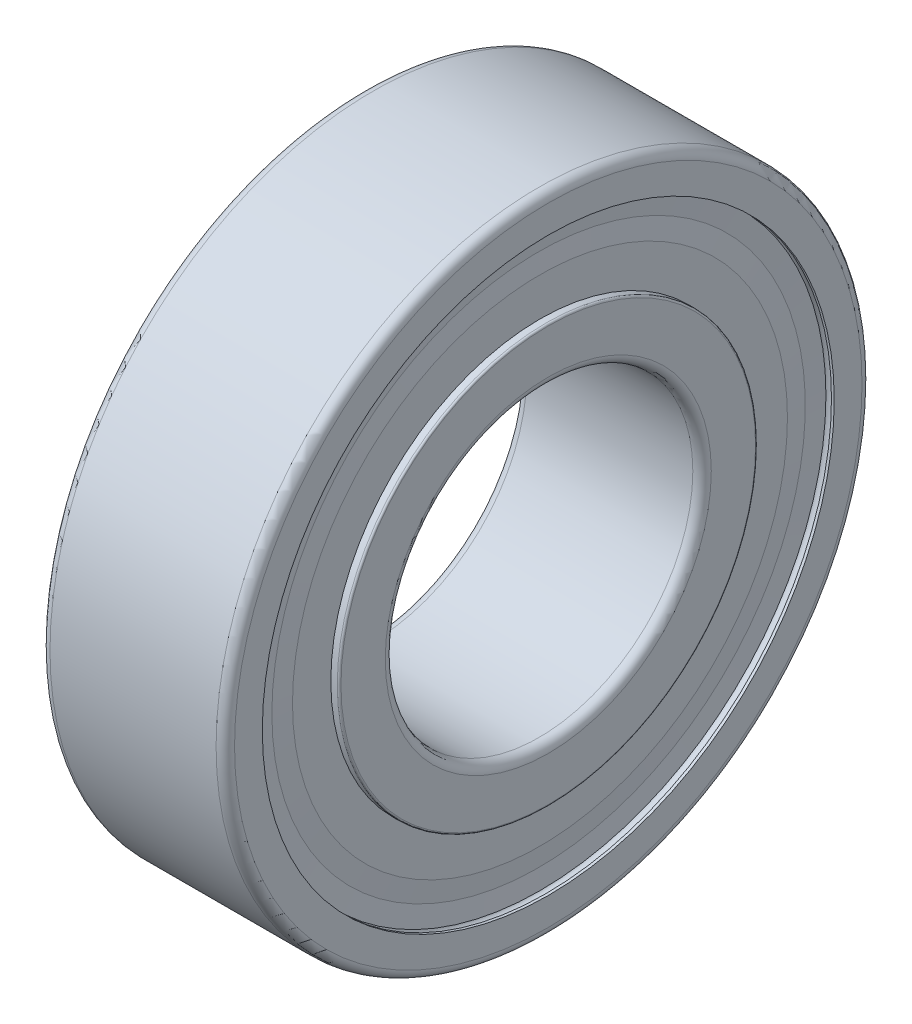
ISO-10303-21;
HEADER;
FILE_DESCRIPTION(('STEP AP214'),'2;1');
FILE_NAME('part.step','',(''),(''),'','','');
FILE_SCHEMA(('AUTOMOTIVE_DESIGN { 1 0 10303 214 1 1 1 1 }'));
ENDSEC;
DATA;
#1=APPLICATION_CONTEXT('core data for automotive mechanical design processes');
#2=APPLICATION_PROTOCOL_DEFINITION('international standard','automotive_design',2000,#1);
#3=PRODUCT_CONTEXT('',#1,'mechanical');
#4=PRODUCT('Part','Part','',(#3));
#5=PRODUCT_RELATED_PRODUCT_CATEGORY('part','',(#4));
#6=PRODUCT_DEFINITION_FORMATION('','',#4);
#7=PRODUCT_DEFINITION_CONTEXT('part definition',#1,'design');
#8=PRODUCT_DEFINITION('design','',#6,#7);
#9=PRODUCT_DEFINITION_SHAPE('','',#8);
#10=(LENGTH_UNIT() NAMED_UNIT(*) SI_UNIT(.MILLI.,.METRE.));
#11=(NAMED_UNIT(*) PLANE_ANGLE_UNIT() SI_UNIT($,.RADIAN.));
#12=(NAMED_UNIT(*) SI_UNIT($,.STERADIAN.) SOLID_ANGLE_UNIT());
#13=UNCERTAINTY_MEASURE_WITH_UNIT(LENGTH_MEASURE(1.E-05),#10,'distance_accuracy_value','');
#14=(GEOMETRIC_REPRESENTATION_CONTEXT(3) GLOBAL_UNCERTAINTY_ASSIGNED_CONTEXT((#13)) GLOBAL_UNIT_ASSIGNED_CONTEXT((#10,
#11,#12)) REPRESENTATION_CONTEXT('',''));
#15=CARTESIAN_POINT('',(0.,0.,0.));
#16=DIRECTION('',(0.,0.,1.));
#17=DIRECTION('',(1.,0.,0.));
#18=AXIS2_PLACEMENT_3D('',#15,#16,#17);
#19=CARTESIAN_POINT('',(50.,0.,0.));
#20=DIRECTION('',(1.,0.,0.));
#21=DIRECTION('',(0.,0.,1.));
#22=AXIS2_PLACEMENT_3D('',#19,#20,#21);
#23=CYLINDRICAL_SURFACE('',#22,18.595);
#24=CARTESIAN_POINT('',(11.46,0.,0.));
#25=DIRECTION('',(-1.,0.,0.));
#26=DIRECTION('',(0.,0.,1.));
#27=AXIS2_PLACEMENT_3D('',#24,#25,#26);
#28=CIRCLE('',#27,18.595);
#29=CARTESIAN_POINT('',(11.46,0.,18.595));
#30=VERTEX_POINT('',#29);
#31=EDGE_CURVE('E12',#30,#30,#28,.T.);
#32=ORIENTED_EDGE('',*,*,#31,.T.);
#33=EDGE_LOOP('',(#32));
#34=FACE_BOUND('',#33,.T.);
#35=CARTESIAN_POINT('',(11.28,0.,0.));
#36=DIRECTION('',(-1.,0.,0.));
#37=DIRECTION('',(0.,0.,1.));
#38=AXIS2_PLACEMENT_3D('',#35,#36,#37);
#39=CIRCLE('',#38,18.595);
#40=CARTESIAN_POINT('',(11.28,0.,18.595));
#41=VERTEX_POINT('',#40);
#42=EDGE_CURVE('E222',#41,#41,#39,.T.);
#43=ORIENTED_EDGE('',*,*,#42,.F.);
#44=EDGE_LOOP('',(#43));
#45=FACE_BOUND('',#44,.T.);
#46=ADVANCED_FACE('F53',(#34,#45),#23,.T.);
#47=CARTESIAN_POINT('',(11.37,0.,0.));
#48=DIRECTION('',(1.,0.,0.));
#49=DIRECTION('',(0.,0.,1.));
#50=AXIS2_PLACEMENT_3D('',#47,#48,#49);
#51=CONICAL_SURFACE('',#50,17.34375,1.49899191472693);
#52=CARTESIAN_POINT('',(11.37,0.,0.));
#53=DIRECTION('',(-1.,0.,0.));
#54=DIRECTION('',(0.,0.,1.));
#55=AXIS2_PLACEMENT_3D('',#52,#53,#54);
#56=CIRCLE('',#55,17.34375);
#57=CARTESIAN_POINT('',(11.37,0.,17.34375));
#58=VERTEX_POINT('',#57);
#59=EDGE_CURVE('E64',#58,#58,#56,.T.);
#60=ORIENTED_EDGE('',*,*,#59,.T.);
#61=EDGE_LOOP('',(#60));
#62=FACE_BOUND('',#61,.T.);
#63=ORIENTED_EDGE('',*,*,#31,.F.);
#64=EDGE_LOOP('',(#63));
#65=FACE_BOUND('',#64,.T.);
#66=ADVANCED_FACE('F273',(#62,#65),#51,.F.);
#67=CARTESIAN_POINT('',(11.46,0.,0.));
#68=DIRECTION('',(-1.,0.,0.));
#69=DIRECTION('',(0.,0.,-1.));
#70=AXIS2_PLACEMENT_3D('',#67,#68,#69);
#71=CONICAL_SURFACE('',#70,16.0925,1.49899191472693);
#72=CARTESIAN_POINT('',(11.46,0.,0.));
#73=DIRECTION('',(-1.,0.,0.));
#74=DIRECTION('',(0.,0.,1.));
#75=AXIS2_PLACEMENT_3D('',#72,#73,#74);
#76=CIRCLE('',#75,16.0925);
#77=CARTESIAN_POINT('',(11.46,0.,16.0925));
#78=VERTEX_POINT('',#77);
#79=EDGE_CURVE('E204',#78,#78,#76,.T.);
#80=ORIENTED_EDGE('',*,*,#79,.T.);
#81=EDGE_LOOP('',(#80));
#82=FACE_BOUND('',#81,.T.);
#83=ORIENTED_EDGE('',*,*,#59,.F.);
#84=EDGE_LOOP('',(#83));
#85=FACE_BOUND('',#84,.T.);
#86=ADVANCED_FACE('F55',(#82,#85),#71,.T.);
#87=CARTESIAN_POINT('',(11.46,13.59,0.));
#88=DIRECTION('',(1.,0.,0.));
#89=DIRECTION('',(0.,1.,0.));
#90=AXIS2_PLACEMENT_3D('',#87,#88,#89);
#91=PLANE('',#90);
#92=CARTESIAN_POINT('',(11.46,0.,0.));
#93=DIRECTION('',(1.,0.,0.));
#94=DIRECTION('',(0.,0.,1.));
#95=AXIS2_PLACEMENT_3D('',#92,#93,#94);
#96=CIRCLE('',#95,13.6);
#97=CARTESIAN_POINT('',(11.46,0.,13.6));
#98=VERTEX_POINT('',#97);
#99=EDGE_CURVE('E126',#98,#98,#96,.T.);
#100=ORIENTED_EDGE('',*,*,#99,.F.);
#101=EDGE_LOOP('',(#100));
#102=FACE_BOUND('',#101,.T.);
#103=ORIENTED_EDGE('',*,*,#79,.F.);
#104=EDGE_LOOP('',(#103));
#105=FACE_BOUND('',#104,.T.);
#106=ADVANCED_FACE('F301',(#102,#105),#91,.T.);
#107=CARTESIAN_POINT('',(11.1,0.,0.));
#108=DIRECTION('',(-1.,0.,0.));
#109=DIRECTION('',(0.,0.,-1.));
#110=AXIS2_PLACEMENT_3D('',#107,#108,#109);
#111=CONICAL_SURFACE('',#110,16.0925,1.49899191472693);
#112=CARTESIAN_POINT('',(11.1,0.,0.));
#113=DIRECTION('',(-1.,0.,0.));
#114=DIRECTION('',(0.,0.,1.));
#115=AXIS2_PLACEMENT_3D('',#112,#113,#114);
#116=CIRCLE('',#115,16.0925);
#117=CARTESIAN_POINT('',(11.1,0.,16.0925));
#118=VERTEX_POINT('',#117);
#119=EDGE_CURVE('E57',#118,#118,#116,.T.);
#120=ORIENTED_EDGE('',*,*,#119,.T.);
#121=EDGE_LOOP('',(#120));
#122=FACE_BOUND('',#121,.T.);
#123=CARTESIAN_POINT('',(11.2792807192807,0.,0.));
#124=DIRECTION('',(-1.,0.,0.));
#125=DIRECTION('',(0.,0.,-1.));
#126=AXIS2_PLACEMENT_3D('',#123,#124,#125);
#127=CIRCLE('',#126,13.6);
#128=CARTESIAN_POINT('',(11.2792807192807,0.,-13.6));
#129=VERTEX_POINT('',#128);
#130=EDGE_CURVE('E212',#129,#129,#127,.T.);
#131=ORIENTED_EDGE('',*,*,#130,.F.);
#132=EDGE_LOOP('',(#131));
#133=FACE_BOUND('',#132,.T.);
#134=ADVANCED_FACE('F268',(#122,#133),#111,.F.);
#135=CARTESIAN_POINT('',(11.1,17.34375,0.));
#136=DIRECTION('',(-1.,0.,0.));
#137=DIRECTION('',(0.,0.,-1.));
#138=AXIS2_PLACEMENT_3D('',#135,#136,#137);
#139=PLANE('',#138);
#140=CARTESIAN_POINT('',(11.1,0.,0.));
#141=DIRECTION('',(-1.,0.,0.));
#142=DIRECTION('',(0.,0.,1.));
#143=AXIS2_PLACEMENT_3D('',#140,#141,#142);
#144=CIRCLE('',#143,17.34375);
#145=CARTESIAN_POINT('',(11.1,0.,17.34375));
#146=VERTEX_POINT('',#145);
#147=EDGE_CURVE('E220',#146,#146,#144,.T.);
#148=ORIENTED_EDGE('',*,*,#147,.T.);
#149=EDGE_LOOP('',(#148));
#150=FACE_BOUND('',#149,.T.);
#151=ORIENTED_EDGE('',*,*,#119,.F.);
#152=EDGE_LOOP('',(#151));
#153=FACE_BOUND('',#152,.T.);
#154=ADVANCED_FACE('F253',(#150,#153),#139,.T.);
#155=CARTESIAN_POINT('',(11.28,0.,0.));
#156=DIRECTION('',(1.,0.,0.));
#157=DIRECTION('',(0.,0.,1.));
#158=AXIS2_PLACEMENT_3D('',#155,#156,#157);
#159=CONICAL_SURFACE('',#158,18.595,1.42792038843124);
#160=ORIENTED_EDGE('',*,*,#42,.T.);
#161=EDGE_LOOP('',(#160));
#162=FACE_BOUND('',#161,.T.);
#163=ORIENTED_EDGE('',*,*,#147,.F.);
#164=EDGE_LOOP('',(#163));
#165=FACE_BOUND('',#164,.T.);
#166=ADVANCED_FACE('F256',(#162,#165),#159,.T.);
#167=CARTESIAN_POINT('',(0.9,0.,0.));
#168=DIRECTION('',(-1.,0.,0.));
#169=DIRECTION('',(0.,0.,-1.));
#170=AXIS2_PLACEMENT_3D('',#167,#168,#169);
#171=CONICAL_SURFACE('',#170,17.34375,1.42792038843124);
#172=CARTESIAN_POINT('',(0.9,0.,0.));
#173=DIRECTION('',(-1.,0.,0.));
#174=DIRECTION('',(0.,0.,1.));
#175=AXIS2_PLACEMENT_3D('',#172,#173,#174);
#176=CIRCLE('',#175,17.34375);
#177=CARTESIAN_POINT('',(0.9,0.,17.34375));
#178=VERTEX_POINT('',#177);
#179=EDGE_CURVE('E217',#178,#178,#176,.T.);
#180=ORIENTED_EDGE('',*,*,#179,.T.);
#181=EDGE_LOOP('',(#180));
#182=FACE_BOUND('',#181,.T.);
#183=CARTESIAN_POINT('',(0.72,0.,0.));
#184=DIRECTION('',(-1.,0.,0.));
#185=DIRECTION('',(0.,0.,1.));
#186=AXIS2_PLACEMENT_3D('',#183,#184,#185);
#187=CIRCLE('',#186,18.595);
#188=CARTESIAN_POINT('',(0.72,0.,18.595));
#189=VERTEX_POINT('',#188);
#190=EDGE_CURVE('E228',#189,#189,#187,.T.);
#191=ORIENTED_EDGE('',*,*,#190,.F.);
#192=EDGE_LOOP('',(#191));
#193=FACE_BOUND('',#192,.T.);
#194=ADVANCED_FACE('F258',(#182,#193),#171,.T.);
#195=CARTESIAN_POINT('',(0.9,16.0925,0.));
#196=DIRECTION('',(1.,0.,0.));
#197=DIRECTION('',(0.,1.,0.));
#198=AXIS2_PLACEMENT_3D('',#195,#196,#197);
#199=PLANE('',#198);
#200=CARTESIAN_POINT('',(0.9,0.,0.));
#201=DIRECTION('',(-1.,0.,0.));
#202=DIRECTION('',(0.,0.,1.));
#203=AXIS2_PLACEMENT_3D('',#200,#201,#202);
#204=CIRCLE('',#203,16.0925);
#205=CARTESIAN_POINT('',(0.9,0.,16.0925));
#206=VERTEX_POINT('',#205);
#207=EDGE_CURVE('E221',#206,#206,#204,.T.);
#208=ORIENTED_EDGE('',*,*,#207,.T.);
#209=EDGE_LOOP('',(#208));
#210=FACE_BOUND('',#209,.T.);
#211=ORIENTED_EDGE('',*,*,#179,.F.);
#212=EDGE_LOOP('',(#211));
#213=FACE_BOUND('',#212,.T.);
#214=ADVANCED_FACE('F265',(#210,#213),#199,.T.);
#215=CARTESIAN_POINT('',(0.72,0.,0.));
#216=DIRECTION('',(1.,0.,0.));
#217=DIRECTION('',(0.,0.,1.));
#218=AXIS2_PLACEMENT_3D('',#215,#216,#217);
#219=CONICAL_SURFACE('',#218,13.59,1.49899191472693);
#220=CARTESIAN_POINT('',(0.720719280719279,0.,0.));
#221=DIRECTION('',(1.,0.,0.));
#222=DIRECTION('',(0.,0.,1.));
#223=AXIS2_PLACEMENT_3D('',#220,#221,#222);
#224=CIRCLE('',#223,13.6);
#225=CARTESIAN_POINT('',(0.720719280719279,0.,13.6));
#226=VERTEX_POINT('',#225);
#227=EDGE_CURVE('E238',#226,#226,#224,.T.);
#228=ORIENTED_EDGE('',*,*,#227,.F.);
#229=EDGE_LOOP('',(#228));
#230=FACE_BOUND('',#229,.T.);
#231=ORIENTED_EDGE('',*,*,#207,.F.);
#232=EDGE_LOOP('',(#231));
#233=FACE_BOUND('',#232,.T.);
#234=ADVANCED_FACE('F283',(#230,#233),#219,.F.);
#235=CARTESIAN_POINT('',(0.54,16.0925,0.));
#236=DIRECTION('',(-1.,0.,0.));
#237=DIRECTION('',(0.,0.,-1.));
#238=AXIS2_PLACEMENT_3D('',#235,#236,#237);
#239=PLANE('',#238);
#240=CARTESIAN_POINT('',(0.54,0.,0.));
#241=DIRECTION('',(-1.,0.,0.));
#242=DIRECTION('',(0.,0.,1.));
#243=AXIS2_PLACEMENT_3D('',#240,#241,#242);
#244=CIRCLE('',#243,16.0925);
#245=CARTESIAN_POINT('',(0.54,0.,16.0925));
#246=VERTEX_POINT('',#245);
#247=EDGE_CURVE('E225',#246,#246,#244,.T.);
#248=ORIENTED_EDGE('',*,*,#247,.T.);
#249=EDGE_LOOP('',(#248));
#250=FACE_BOUND('',#249,.T.);
#251=CARTESIAN_POINT('',(0.54,0.,0.));
#252=DIRECTION('',(-1.,0.,0.));
#253=DIRECTION('',(0.,0.,-1.));
#254=AXIS2_PLACEMENT_3D('',#251,#252,#253);
#255=CIRCLE('',#254,13.6);
#256=CARTESIAN_POINT('',(0.54,0.,-13.6));
#257=VERTEX_POINT('',#256);
#258=EDGE_CURVE('E207',#257,#257,#255,.T.);
#259=ORIENTED_EDGE('',*,*,#258,.F.);
#260=EDGE_LOOP('',(#259));
#261=FACE_BOUND('',#260,.T.);
#262=ADVANCED_FACE('F286',(#250,#261),#239,.T.);
#263=CARTESIAN_POINT('',(0.63,0.,0.));
#264=DIRECTION('',(1.,0.,0.));
#265=DIRECTION('',(0.,0.,1.));
#266=AXIS2_PLACEMENT_3D('',#263,#264,#265);
#267=CONICAL_SURFACE('',#266,17.34375,1.49899191472693);
#268=CARTESIAN_POINT('',(0.63,0.,0.));
#269=DIRECTION('',(-1.,0.,0.));
#270=DIRECTION('',(0.,0.,1.));
#271=AXIS2_PLACEMENT_3D('',#268,#269,#270);
#272=CIRCLE('',#271,17.34375);
#273=CARTESIAN_POINT('',(0.63,0.,17.34375));
#274=VERTEX_POINT('',#273);
#275=EDGE_CURVE('E227',#274,#274,#272,.T.);
#276=ORIENTED_EDGE('',*,*,#275,.T.);
#277=EDGE_LOOP('',(#276));
#278=FACE_BOUND('',#277,.T.);
#279=ORIENTED_EDGE('',*,*,#247,.F.);
#280=EDGE_LOOP('',(#279));
#281=FACE_BOUND('',#280,.T.);
#282=ADVANCED_FACE('F308',(#278,#281),#267,.T.);
#283=CARTESIAN_POINT('',(0.54,0.,0.));
#284=DIRECTION('',(-1.,0.,0.));
#285=DIRECTION('',(0.,0.,-1.));
#286=AXIS2_PLACEMENT_3D('',#283,#284,#285);
#287=CONICAL_SURFACE('',#286,18.595,1.49899191472693);
#288=CARTESIAN_POINT('',(0.54,0.,0.));
#289=DIRECTION('',(-1.,0.,0.));
#290=DIRECTION('',(0.,0.,1.));
#291=AXIS2_PLACEMENT_3D('',#288,#289,#290);
#292=CIRCLE('',#291,18.595);
#293=CARTESIAN_POINT('',(0.54,0.,18.595));
#294=VERTEX_POINT('',#293);
#295=EDGE_CURVE('E230',#294,#294,#292,.T.);
#296=ORIENTED_EDGE('',*,*,#295,.T.);
#297=EDGE_LOOP('',(#296));
#298=FACE_BOUND('',#297,.T.);
#299=ORIENTED_EDGE('',*,*,#275,.F.);
#300=EDGE_LOOP('',(#299));
#301=FACE_BOUND('',#300,.T.);
#302=ADVANCED_FACE('F311',(#298,#301),#287,.F.);
#303=CARTESIAN_POINT('',(50.,0.,0.));
#304=DIRECTION('',(1.,0.,0.));
#305=DIRECTION('',(0.,0.,1.));
#306=AXIS2_PLACEMENT_3D('',#303,#304,#305);
#307=CYLINDRICAL_SURFACE('',#306,18.595);
#308=ORIENTED_EDGE('',*,*,#190,.T.);
#309=EDGE_LOOP('',(#308));
#310=FACE_BOUND('',#309,.T.);
#311=ORIENTED_EDGE('',*,*,#295,.F.);
#312=EDGE_LOOP('',(#311));
#313=FACE_BOUND('',#312,.T.);
#314=ADVANCED_FACE('F484',(#310,#313),#307,.T.);
#315=CARTESIAN_POINT('',(50.,0.,0.));
#316=DIRECTION('',(1.,0.,0.));
#317=DIRECTION('',(0.,0.,1.));
#318=AXIS2_PLACEMENT_3D('',#315,#316,#317);
#319=CYLINDRICAL_SURFACE('',#318,13.6);
#320=CARTESIAN_POINT('',(3.45625767814427,0.,0.));
#321=DIRECTION('',(-1.,0.,0.));
#322=DIRECTION('',(0.,0.,1.));
#323=AXIS2_PLACEMENT_3D('',#320,#321,#322);
#324=CIRCLE('',#323,13.6);
#325=CARTESIAN_POINT('',(3.45625767814427,0.,13.6));
#326=VERTEX_POINT('',#325);
#327=EDGE_CURVE('E245',#326,#326,#324,.T.);
#328=ORIENTED_EDGE('',*,*,#327,.T.);
#329=EDGE_LOOP('',(#328));
#330=FACE_BOUND('',#329,.T.);
#331=ORIENTED_EDGE('',*,*,#227,.T.);
#332=EDGE_LOOP('',(#331));
#333=FACE_BOUND('',#332,.T.);
#334=ADVANCED_FACE('F399',(#330,#333),#319,.T.);
#335=CARTESIAN_POINT('',(6.,0.,0.));
#336=DIRECTION('',(1.,0.,0.));
#337=DIRECTION('',(0.,0.,1.));
#338=AXIS2_PLACEMENT_3D('',#335,#336,#337);
#339=TOROIDAL_SURFACE('',#338,15.5,3.175);
#340=ORIENTED_EDGE('',*,*,#327,.F.);
#341=EDGE_LOOP('',(#340));
#342=FACE_BOUND('',#341,.T.);
#343=CARTESIAN_POINT('',(8.54374232185574,0.,0.));
#344=DIRECTION('',(-1.,0.,0.));
#345=DIRECTION('',(0.,0.,1.));
#346=AXIS2_PLACEMENT_3D('',#343,#344,#345);
#347=CIRCLE('',#346,13.6);
#348=CARTESIAN_POINT('',(8.54374232185574,0.,13.6));
#349=VERTEX_POINT('',#348);
#350=EDGE_CURVE('E216',#349,#349,#347,.T.);
#351=ORIENTED_EDGE('',*,*,#350,.T.);
#352=EDGE_LOOP('',(#351));
#353=FACE_BOUND('',#352,.T.);
#354=ADVANCED_FACE('F393',(#342,#353),#339,.F.);
#355=CARTESIAN_POINT('',(50.,0.,0.));
#356=DIRECTION('',(1.,0.,0.));
#357=DIRECTION('',(0.,0.,1.));
#358=AXIS2_PLACEMENT_3D('',#355,#356,#357);
#359=CYLINDRICAL_SURFACE('',#358,13.6);
#360=CARTESIAN_POINT('',(11.88,0.,0.));
#361=DIRECTION('',(-1.,0.,0.));
#362=DIRECTION('',(0.,0.,1.));
#363=AXIS2_PLACEMENT_3D('',#360,#361,#362);
#364=CIRCLE('',#363,13.6);
#365=CARTESIAN_POINT('',(11.88,0.,13.6));
#366=VERTEX_POINT('',#365);
#367=EDGE_CURVE('E139',#366,#366,#364,.T.);
#368=ORIENTED_EDGE('',*,*,#367,.T.);
#369=EDGE_LOOP('',(#368));
#370=FACE_BOUND('',#369,.T.);
#371=ORIENTED_EDGE('',*,*,#99,.T.);
#372=EDGE_LOOP('',(#371));
#373=FACE_BOUND('',#372,.T.);
#374=ADVANCED_FACE('F398',(#370,#373),#359,.T.);
#375=CARTESIAN_POINT('',(11.88,0.,0.));
#376=DIRECTION('',(1.,0.,0.));
#377=DIRECTION('',(0.,0.,1.));
#378=AXIS2_PLACEMENT_3D('',#375,#376,#377);
#379=TOROIDAL_SURFACE('',#378,13.48,0.12);
#380=CARTESIAN_POINT('',(12.,0.,0.));
#381=DIRECTION('',(-1.,0.,0.));
#382=DIRECTION('',(0.,0.,1.));
#383=AXIS2_PLACEMENT_3D('',#380,#381,#382);
#384=CIRCLE('',#383,13.48);
#385=CARTESIAN_POINT('',(12.,0.,13.48));
#386=VERTEX_POINT('',#385);
#387=EDGE_CURVE('E187',#386,#386,#384,.T.);
#388=ORIENTED_EDGE('',*,*,#387,.T.);
#389=EDGE_LOOP('',(#388));
#390=FACE_BOUND('',#389,.T.);
#391=ORIENTED_EDGE('',*,*,#367,.F.);
#392=EDGE_LOOP('',(#391));
#393=FACE_BOUND('',#392,.T.);
#394=ADVANCED_FACE('F306',(#390,#393),#379,.T.);
#395=CARTESIAN_POINT('',(12.,10.6,0.));
#396=DIRECTION('',(1.,0.,0.));
#397=DIRECTION('',(0.,1.,0.));
#398=AXIS2_PLACEMENT_3D('',#395,#396,#397);
#399=PLANE('',#398);
#400=CARTESIAN_POINT('',(12.,0.,0.));
#401=DIRECTION('',(-1.,0.,0.));
#402=DIRECTION('',(0.,0.,1.));
#403=AXIS2_PLACEMENT_3D('',#400,#401,#402);
#404=CIRCLE('',#403,10.6);
#405=CARTESIAN_POINT('',(12.,0.,10.6));
#406=VERTEX_POINT('',#405);
#407=EDGE_CURVE('E180',#406,#406,#404,.T.);
#408=ORIENTED_EDGE('',*,*,#407,.T.);
#409=EDGE_LOOP('',(#408));
#410=FACE_BOUND('',#409,.T.);
#411=ORIENTED_EDGE('',*,*,#387,.F.);
#412=EDGE_LOOP('',(#411));
#413=FACE_BOUND('',#412,.T.);
#414=ADVANCED_FACE('F303',(#410,#413),#399,.T.);
#415=CARTESIAN_POINT('',(11.4,0.,0.));
#416=DIRECTION('',(1.,0.,0.));
#417=DIRECTION('',(0.,0.,1.));
#418=AXIS2_PLACEMENT_3D('',#415,#416,#417);
#419=TOROIDAL_SURFACE('',#418,10.6,0.6);
#420=CARTESIAN_POINT('',(11.4,0.,0.));
#421=DIRECTION('',(-1.,0.,0.));
#422=DIRECTION('',(0.,0.,1.));
#423=AXIS2_PLACEMENT_3D('',#420,#421,#422);
#424=CIRCLE('',#423,10.);
#425=CARTESIAN_POINT('',(11.4,0.,10.));
#426=VERTEX_POINT('',#425);
#427=EDGE_CURVE('E175',#426,#426,#424,.T.);
#428=ORIENTED_EDGE('',*,*,#427,.T.);
#429=EDGE_LOOP('',(#428));
#430=FACE_BOUND('',#429,.T.);
#431=ORIENTED_EDGE('',*,*,#407,.F.);
#432=EDGE_LOOP('',(#431));
#433=FACE_BOUND('',#432,.T.);
#434=ADVANCED_FACE('F176',(#430,#433),#419,.T.);
#435=CARTESIAN_POINT('',(50.,0.,0.));
#436=DIRECTION('',(1.,0.,0.));
#437=DIRECTION('',(0.,0.,1.));
#438=AXIS2_PLACEMENT_3D('',#435,#436,#437);
#439=CYLINDRICAL_SURFACE('',#438,10.);
#440=CARTESIAN_POINT('',(0.6,0.,0.));
#441=DIRECTION('',(-1.,0.,0.));
#442=DIRECTION('',(0.,0.,1.));
#443=AXIS2_PLACEMENT_3D('',#440,#441,#442);
#444=CIRCLE('',#443,10.);
#445=CARTESIAN_POINT('',(0.6,0.,10.));
#446=VERTEX_POINT('',#445);
#447=EDGE_CURVE('E181',#446,#446,#444,.T.);
#448=ORIENTED_EDGE('',*,*,#447,.T.);
#449=EDGE_LOOP('',(#448));
#450=FACE_BOUND('',#449,.T.);
#451=ORIENTED_EDGE('',*,*,#427,.F.);
#452=EDGE_LOOP('',(#451));
#453=FACE_BOUND('',#452,.T.);
#454=ADVANCED_FACE('F292',(#450,#453),#439,.F.);
#455=CARTESIAN_POINT('',(0.6,0.,0.));
#456=DIRECTION('',(1.,0.,0.));
#457=DIRECTION('',(0.,0.,1.));
#458=AXIS2_PLACEMENT_3D('',#455,#456,#457);
#459=TOROIDAL_SURFACE('',#458,10.6,0.6);
#460=CARTESIAN_POINT('',(0.,0.,0.));
#461=DIRECTION('',(-1.,0.,0.));
#462=DIRECTION('',(0.,0.,1.));
#463=AXIS2_PLACEMENT_3D('',#460,#461,#462);
#464=CIRCLE('',#463,10.6);
#465=CARTESIAN_POINT('',(0.,0.,10.6));
#466=VERTEX_POINT('',#465);
#467=EDGE_CURVE('E189',#466,#466,#464,.T.);
#468=ORIENTED_EDGE('',*,*,#467,.T.);
#469=EDGE_LOOP('',(#468));
#470=FACE_BOUND('',#469,.T.);
#471=ORIENTED_EDGE('',*,*,#447,.F.);
#472=EDGE_LOOP('',(#471));
#473=FACE_BOUND('',#472,.T.);
#474=ADVANCED_FACE('F288',(#470,#473),#459,.T.);
#475=CARTESIAN_POINT('',(0.,13.48,0.));
#476=DIRECTION('',(-1.,0.,0.));
#477=DIRECTION('',(0.,0.,-1.));
#478=AXIS2_PLACEMENT_3D('',#475,#476,#477);
#479=PLANE('',#478);
#480=CARTESIAN_POINT('',(0.,0.,0.));
#481=DIRECTION('',(-1.,0.,0.));
#482=DIRECTION('',(0.,0.,1.));
#483=AXIS2_PLACEMENT_3D('',#480,#481,#482);
#484=CIRCLE('',#483,13.48);
#485=CARTESIAN_POINT('',(0.,0.,13.48));
#486=VERTEX_POINT('',#485);
#487=EDGE_CURVE('E197',#486,#486,#484,.T.);
#488=ORIENTED_EDGE('',*,*,#487,.T.);
#489=EDGE_LOOP('',(#488));
#490=FACE_BOUND('',#489,.T.);
#491=ORIENTED_EDGE('',*,*,#467,.F.);
#492=EDGE_LOOP('',(#491));
#493=FACE_BOUND('',#492,.T.);
#494=ADVANCED_FACE('F291',(#490,#493),#479,.T.);
#495=CARTESIAN_POINT('',(0.12,0.,0.));
#496=DIRECTION('',(1.,0.,0.));
#497=DIRECTION('',(0.,0.,1.));
#498=AXIS2_PLACEMENT_3D('',#495,#496,#497);
#499=TOROIDAL_SURFACE('',#498,13.48,0.12);
#500=CARTESIAN_POINT('',(0.120000000000002,0.,0.));
#501=DIRECTION('',(-1.,0.,0.));
#502=DIRECTION('',(0.,0.,1.));
#503=AXIS2_PLACEMENT_3D('',#500,#501,#502);
#504=CIRCLE('',#503,13.6);
#505=CARTESIAN_POINT('',(0.120000000000002,0.,13.6));
#506=VERTEX_POINT('',#505);
#507=EDGE_CURVE('E210',#506,#506,#504,.T.);
#508=ORIENTED_EDGE('',*,*,#507,.T.);
#509=EDGE_LOOP('',(#508));
#510=FACE_BOUND('',#509,.T.);
#511=ORIENTED_EDGE('',*,*,#487,.F.);
#512=EDGE_LOOP('',(#511));
#513=FACE_BOUND('',#512,.T.);
#514=ADVANCED_FACE('F294',(#510,#513),#499,.T.);
#515=CARTESIAN_POINT('',(50.,0.,0.));
#516=DIRECTION('',(1.,0.,0.));
#517=DIRECTION('',(0.,0.,1.));
#518=AXIS2_PLACEMENT_3D('',#515,#516,#517);
#519=CYLINDRICAL_SURFACE('',#518,13.6);
#520=ORIENTED_EDGE('',*,*,#258,.T.);
#521=EDGE_LOOP('',(#520));
#522=FACE_BOUND('',#521,.T.);
#523=ORIENTED_EDGE('',*,*,#507,.F.);
#524=EDGE_LOOP('',(#523));
#525=FACE_BOUND('',#524,.T.);
#526=ADVANCED_FACE('F297',(#522,#525),#519,.T.);
#527=CARTESIAN_POINT('',(50.,0.,0.));
#528=DIRECTION('',(1.,0.,0.));
#529=DIRECTION('',(0.,0.,1.));
#530=AXIS2_PLACEMENT_3D('',#527,#528,#529);
#531=CYLINDRICAL_SURFACE('',#530,13.6);
#532=ORIENTED_EDGE('',*,*,#130,.T.);
#533=EDGE_LOOP('',(#532));
#534=FACE_BOUND('',#533,.T.);
#535=ORIENTED_EDGE('',*,*,#350,.F.);
#536=EDGE_LOOP('',(#535));
#537=FACE_BOUND('',#536,.T.);
#538=ADVANCED_FACE('F313',(#534,#537),#531,.T.);
#539=CLOSED_SHELL('',(#46,#66,#86,#106,#134,#154,#166,#194,#214,#234,#262,#282,#302,#314,#334,
#354,#374,#394,#414,#434,#454,#474,#494,#514,#526,#538));
#540=MANIFOLD_SOLID_BREP('B2',#539);
#541=CARTESIAN_POINT('',(50.,0.,0.));
#542=DIRECTION('',(1.,0.,0.));
#543=DIRECTION('',(0.,0.,1.));
#544=AXIS2_PLACEMENT_3D('',#541,#542,#543);
#545=CYLINDRICAL_SURFACE('',#544,21.);
#546=CARTESIAN_POINT('',(11.4,0.,0.));
#547=DIRECTION('',(-1.,0.,0.));
#548=DIRECTION('',(0.,0.,1.));
#549=AXIS2_PLACEMENT_3D('',#546,#547,#548);
#550=CIRCLE('',#549,21.);
#551=CARTESIAN_POINT('',(11.4,0.,21.));
#552=VERTEX_POINT('',#551);
#553=EDGE_CURVE('E51',#552,#552,#550,.T.);
#554=ORIENTED_EDGE('',*,*,#553,.T.);
#555=EDGE_LOOP('',(#554));
#556=FACE_BOUND('',#555,.T.);
#557=CARTESIAN_POINT('',(0.6,0.,0.));
#558=DIRECTION('',(-1.,0.,0.));
#559=DIRECTION('',(0.,0.,1.));
#560=AXIS2_PLACEMENT_3D('',#557,#558,#559);
#561=CIRCLE('',#560,21.);
#562=CARTESIAN_POINT('',(0.6,0.,21.));
#563=VERTEX_POINT('',#562);
#564=EDGE_CURVE('E828',#563,#563,#561,.T.);
#565=ORIENTED_EDGE('',*,*,#564,.F.);
#566=EDGE_LOOP('',(#565));
#567=FACE_BOUND('',#566,.T.);
#568=ADVANCED_FACE('F729',(#556,#567),#545,.T.);
#569=CARTESIAN_POINT('',(11.4,0.,0.));
#570=DIRECTION('',(1.,0.,0.));
#571=DIRECTION('',(0.,0.,1.));
#572=AXIS2_PLACEMENT_3D('',#569,#570,#571);
#573=TOROIDAL_SURFACE('',#572,20.4,0.600000000000007);
#574=CARTESIAN_POINT('',(12.,0.,0.));
#575=DIRECTION('',(-1.,0.,0.));
#576=DIRECTION('',(0.,0.,1.));
#577=AXIS2_PLACEMENT_3D('',#574,#575,#576);
#578=CIRCLE('',#577,20.4);
#579=CARTESIAN_POINT('',(12.,0.,20.4));
#580=VERTEX_POINT('',#579);
#581=EDGE_CURVE('E740',#580,#580,#578,.T.);
#582=ORIENTED_EDGE('',*,*,#581,.T.);
#583=EDGE_LOOP('',(#582));
#584=FACE_BOUND('',#583,.T.);
#585=ORIENTED_EDGE('',*,*,#553,.F.);
#586=EDGE_LOOP('',(#585));
#587=FACE_BOUND('',#586,.T.);
#588=ADVANCED_FACE('F864',(#584,#587),#573,.T.);
#589=CARTESIAN_POINT('',(12.,18.595,0.));
#590=DIRECTION('',(1.,0.,0.));
#591=DIRECTION('',(0.,1.,0.));
#592=AXIS2_PLACEMENT_3D('',#589,#590,#591);
#593=PLANE('',#592);
#594=CARTESIAN_POINT('',(12.,0.,0.));
#595=DIRECTION('',(-1.,0.,0.));
#596=DIRECTION('',(0.,0.,1.));
#597=AXIS2_PLACEMENT_3D('',#594,#595,#596);
#598=CIRCLE('',#597,18.595);
#599=CARTESIAN_POINT('',(12.,0.,18.595));
#600=VERTEX_POINT('',#599);
#601=EDGE_CURVE('E823',#600,#600,#598,.T.);
#602=ORIENTED_EDGE('',*,*,#601,.T.);
#603=EDGE_LOOP('',(#602));
#604=FACE_BOUND('',#603,.T.);
#605=ORIENTED_EDGE('',*,*,#581,.F.);
#606=EDGE_LOOP('',(#605));
#607=FACE_BOUND('',#606,.T.);
#608=ADVANCED_FACE('F869',(#604,#607),#593,.T.);
#609=CARTESIAN_POINT('',(50.,0.,0.));
#610=DIRECTION('',(1.,0.,0.));
#611=DIRECTION('',(0.,0.,1.));
#612=AXIS2_PLACEMENT_3D('',#609,#610,#611);
#613=CYLINDRICAL_SURFACE('',#612,18.595);
#614=CARTESIAN_POINT('',(11.82,0.,0.));
#615=DIRECTION('',(-1.,0.,0.));
#616=DIRECTION('',(0.,0.,1.));
#617=AXIS2_PLACEMENT_3D('',#614,#615,#616);
#618=CIRCLE('',#617,18.595);
#619=CARTESIAN_POINT('',(11.82,0.,18.595));
#620=VERTEX_POINT('',#619);
#621=EDGE_CURVE('E820',#620,#620,#618,.T.);
#622=ORIENTED_EDGE('',*,*,#621,.T.);
#623=EDGE_LOOP('',(#622));
#624=FACE_BOUND('',#623,.T.);
#625=ORIENTED_EDGE('',*,*,#601,.F.);
#626=EDGE_LOOP('',(#625));
#627=FACE_BOUND('',#626,.T.);
#628=ADVANCED_FACE('F859',(#624,#627),#613,.F.);
#629=CARTESIAN_POINT('',(11.46,0.,0.));
#630=DIRECTION('',(1.,0.,0.));
#631=DIRECTION('',(0.,0.,1.));
#632=AXIS2_PLACEMENT_3D('',#629,#630,#631);
#633=TOROIDAL_SURFACE('',#632,18.5950000189953,0.36);
#634=ORIENTED_EDGE('',*,*,#621,.F.);
#635=EDGE_LOOP('',(#634));
#636=FACE_BOUND('',#635,.T.);
#637=CARTESIAN_POINT('',(11.1,0.,0.));
#638=DIRECTION('',(-1.,0.,0.));
#639=DIRECTION('',(0.,0.,1.));
#640=AXIS2_PLACEMENT_3D('',#637,#638,#639);
#641=CIRCLE('',#640,18.595);
#642=CARTESIAN_POINT('',(11.1,0.,18.595));
#643=VERTEX_POINT('',#642);
#644=EDGE_CURVE('E824',#643,#643,#641,.T.);
#645=ORIENTED_EDGE('',*,*,#644,.T.);
#646=EDGE_LOOP('',(#645));
#647=FACE_BOUND('',#646,.T.);
#648=ADVANCED_FACE('F731',(#636,#647),#633,.F.);
#649=CARTESIAN_POINT('',(10.8892892580534,0.,0.));
#650=DIRECTION('',(1.,0.,0.));
#651=DIRECTION('',(0.,0.,1.));
#652=AXIS2_PLACEMENT_3D('',#649,#650,#651);
#653=CONICAL_SURFACE('',#652,17.4,1.39626340159546);
#654=CARTESIAN_POINT('',(10.8892892580534,0.,0.));
#655=DIRECTION('',(-1.,0.,0.));
#656=DIRECTION('',(0.,0.,1.));
#657=AXIS2_PLACEMENT_3D('',#654,#655,#656);
#658=CIRCLE('',#657,17.4);
#659=CARTESIAN_POINT('',(10.8892892580534,0.,17.4));
#660=VERTEX_POINT('',#659);
#661=EDGE_CURVE('E808',#660,#660,#658,.T.);
#662=ORIENTED_EDGE('',*,*,#661,.T.);
#663=EDGE_LOOP('',(#662));
#664=FACE_BOUND('',#663,.T.);
#665=ORIENTED_EDGE('',*,*,#644,.F.);
#666=EDGE_LOOP('',(#665));
#667=FACE_BOUND('',#666,.T.);
#668=ADVANCED_FACE('F848',(#664,#667),#653,.F.);
#669=CARTESIAN_POINT('',(50.,0.,0.));
#670=DIRECTION('',(1.,0.,0.));
#671=DIRECTION('',(0.,0.,1.));
#672=AXIS2_PLACEMENT_3D('',#669,#670,#671);
#673=CYLINDRICAL_SURFACE('',#672,17.4);
#674=CARTESIAN_POINT('',(8.54374232185574,0.,0.));
#675=DIRECTION('',(-1.,0.,0.));
#676=DIRECTION('',(0.,0.,1.));
#677=AXIS2_PLACEMENT_3D('',#674,#675,#676);
#678=CIRCLE('',#677,17.4);
#679=CARTESIAN_POINT('',(8.54374232185574,0.,17.4));
#680=VERTEX_POINT('',#679);
#681=EDGE_CURVE('E802',#680,#680,#678,.T.);
#682=ORIENTED_EDGE('',*,*,#681,.T.);
#683=EDGE_LOOP('',(#682));
#684=FACE_BOUND('',#683,.T.);
#685=ORIENTED_EDGE('',*,*,#661,.F.);
#686=EDGE_LOOP('',(#685));
#687=FACE_BOUND('',#686,.T.);
#688=ADVANCED_FACE('F850',(#684,#687),#673,.F.);
#689=CARTESIAN_POINT('',(6.,0.,0.));
#690=DIRECTION('',(1.,0.,0.));
#691=DIRECTION('',(0.,0.,1.));
#692=AXIS2_PLACEMENT_3D('',#689,#690,#691);
#693=TOROIDAL_SURFACE('',#692,15.5,3.175);
#694=ORIENTED_EDGE('',*,*,#681,.F.);
#695=EDGE_LOOP('',(#694));
#696=FACE_BOUND('',#695,.T.);
#697=CARTESIAN_POINT('',(3.45625767814427,0.,0.));
#698=DIRECTION('',(-1.,0.,0.));
#699=DIRECTION('',(0.,0.,1.));
#700=AXIS2_PLACEMENT_3D('',#697,#698,#699);
#701=CIRCLE('',#700,17.4);
#702=CARTESIAN_POINT('',(3.45625767814427,0.,17.4));
#703=VERTEX_POINT('',#702);
#704=EDGE_CURVE('E733',#703,#703,#701,.T.);
#705=ORIENTED_EDGE('',*,*,#704,.T.);
#706=EDGE_LOOP('',(#705));
#707=FACE_BOUND('',#706,.T.);
#708=ADVANCED_FACE('F799',(#696,#707),#693,.F.);
#709=CARTESIAN_POINT('',(50.,0.,0.));
#710=DIRECTION('',(1.,0.,0.));
#711=DIRECTION('',(0.,0.,1.));
#712=AXIS2_PLACEMENT_3D('',#709,#710,#711);
#713=CYLINDRICAL_SURFACE('',#712,17.4);
#714=CARTESIAN_POINT('',(1.11071074194662,0.,0.));
#715=DIRECTION('',(-1.,0.,0.));
#716=DIRECTION('',(0.,0.,1.));
#717=AXIS2_PLACEMENT_3D('',#714,#715,#716);
#718=CIRCLE('',#717,17.4);
#719=CARTESIAN_POINT('',(1.11071074194662,0.,17.4));
#720=VERTEX_POINT('',#719);
#721=EDGE_CURVE('E803',#720,#720,#718,.T.);
#722=ORIENTED_EDGE('',*,*,#721,.T.);
#723=EDGE_LOOP('',(#722));
#724=FACE_BOUND('',#723,.T.);
#725=ORIENTED_EDGE('',*,*,#704,.F.);
#726=EDGE_LOOP('',(#725));
#727=FACE_BOUND('',#726,.T.);
#728=ADVANCED_FACE('F891',(#724,#727),#713,.F.);
#729=CARTESIAN_POINT('',(0.9,0.,0.));
#730=DIRECTION('',(-1.,0.,0.));
#731=DIRECTION('',(0.,0.,-1.));
#732=AXIS2_PLACEMENT_3D('',#729,#730,#731);
#733=CONICAL_SURFACE('',#732,18.595,1.39626340159547);
#734=CARTESIAN_POINT('',(0.9,0.,0.));
#735=DIRECTION('',(-1.,0.,0.));
#736=DIRECTION('',(0.,0.,1.));
#737=AXIS2_PLACEMENT_3D('',#734,#735,#736);
#738=CIRCLE('',#737,18.595);
#739=CARTESIAN_POINT('',(0.9,0.,18.595));
#740=VERTEX_POINT('',#739);
#741=EDGE_CURVE('E810',#740,#740,#738,.T.);
#742=ORIENTED_EDGE('',*,*,#741,.T.);
#743=EDGE_LOOP('',(#742));
#744=FACE_BOUND('',#743,.T.);
#745=ORIENTED_EDGE('',*,*,#721,.F.);
#746=EDGE_LOOP('',(#745));
#747=FACE_BOUND('',#746,.T.);
#748=ADVANCED_FACE('F882',(#744,#747),#733,.F.);
#749=CARTESIAN_POINT('',(0.54,0.,0.));
#750=DIRECTION('',(1.,0.,0.));
#751=DIRECTION('',(0.,0.,1.));
#752=AXIS2_PLACEMENT_3D('',#749,#750,#751);
#753=TOROIDAL_SURFACE('',#752,18.595,0.36);
#754=ORIENTED_EDGE('',*,*,#741,.F.);
#755=EDGE_LOOP('',(#754));
#756=FACE_BOUND('',#755,.T.);
#757=CARTESIAN_POINT('',(0.18,0.,0.));
#758=DIRECTION('',(-1.,0.,0.));
#759=DIRECTION('',(0.,0.,1.));
#760=AXIS2_PLACEMENT_3D('',#757,#758,#759);
#761=CIRCLE('',#760,18.595);
#762=CARTESIAN_POINT('',(0.18,0.,18.595));
#763=VERTEX_POINT('',#762);
#764=EDGE_CURVE('E817',#763,#763,#761,.T.);
#765=ORIENTED_EDGE('',*,*,#764,.T.);
#766=EDGE_LOOP('',(#765));
#767=FACE_BOUND('',#766,.T.);
#768=ADVANCED_FACE('F879',(#756,#767),#753,.F.);
#769=CARTESIAN_POINT('',(50.,0.,0.));
#770=DIRECTION('',(1.,0.,0.));
#771=DIRECTION('',(0.,0.,1.));
#772=AXIS2_PLACEMENT_3D('',#769,#770,#771);
#773=CYLINDRICAL_SURFACE('',#772,18.595);
#774=CARTESIAN_POINT('',(0.,0.,0.));
#775=DIRECTION('',(-1.,0.,0.));
#776=DIRECTION('',(0.,0.,1.));
#777=AXIS2_PLACEMENT_3D('',#774,#775,#776);
#778=CIRCLE('',#777,18.595);
#779=CARTESIAN_POINT('',(0.,0.,18.595));
#780=VERTEX_POINT('',#779);
#781=EDGE_CURVE('E834',#780,#780,#778,.T.);
#782=ORIENTED_EDGE('',*,*,#781,.T.);
#783=EDGE_LOOP('',(#782));
#784=FACE_BOUND('',#783,.T.);
#785=ORIENTED_EDGE('',*,*,#764,.F.);
#786=EDGE_LOOP('',(#785));
#787=FACE_BOUND('',#786,.T.);
#788=ADVANCED_FACE('F881',(#784,#787),#773,.F.);
#789=CARTESIAN_POINT('',(0.,20.4,0.));
#790=DIRECTION('',(-1.,0.,0.));
#791=DIRECTION('',(0.,0.,-1.));
#792=AXIS2_PLACEMENT_3D('',#789,#790,#791);
#793=PLANE('',#792);
#794=CARTESIAN_POINT('',(0.,0.,0.));
#795=DIRECTION('',(-1.,0.,0.));
#796=DIRECTION('',(0.,0.,1.));
#797=AXIS2_PLACEMENT_3D('',#794,#795,#796);
#798=CIRCLE('',#797,20.4);
#799=CARTESIAN_POINT('',(0.,0.,20.4));
#800=VERTEX_POINT('',#799);
#801=EDGE_CURVE('E825',#800,#800,#798,.T.);
#802=ORIENTED_EDGE('',*,*,#801,.T.);
#803=EDGE_LOOP('',(#802));
#804=FACE_BOUND('',#803,.T.);
#805=ORIENTED_EDGE('',*,*,#781,.F.);
#806=EDGE_LOOP('',(#805));
#807=FACE_BOUND('',#806,.T.);
#808=ADVANCED_FACE('F874',(#804,#807),#793,.T.);
#809=CARTESIAN_POINT('',(0.6,0.,0.));
#810=DIRECTION('',(1.,0.,0.));
#811=DIRECTION('',(0.,0.,1.));
#812=AXIS2_PLACEMENT_3D('',#809,#810,#811);
#813=TOROIDAL_SURFACE('',#812,20.4,0.600000000000007);
#814=ORIENTED_EDGE('',*,*,#564,.T.);
#815=EDGE_LOOP('',(#814));
#816=FACE_BOUND('',#815,.T.);
#817=ORIENTED_EDGE('',*,*,#801,.F.);
#818=EDGE_LOOP('',(#817));
#819=FACE_BOUND('',#818,.T.);
#820=ADVANCED_FACE('F875',(#816,#819),#813,.T.);
#821=CLOSED_SHELL('',(#568,#588,#608,#628,#648,#668,#688,#708,#728,#748,#768,#788,#808,#820));
#822=MANIFOLD_SOLID_BREP('B6',#821);
#823=CARTESIAN_POINT('',(6.,15.5,0.));
#824=DIRECTION('',(1.,0.,0.));
#825=DIRECTION('',(0.,-1.,0.));
#826=AXIS2_PLACEMENT_3D('',#823,#824,#825);
#827=SPHERICAL_SURFACE('',#826,3.175);
#828=CARTESIAN_POINT('',(2.825,15.5,0.));
#829=VERTEX_POINT('',#828);
#830=VERTEX_LOOP('',#829);
#831=FACE_BOUND('',#830,.T.);
#832=ADVANCED_FACE('F1105',(#831),#827,.T.);
#833=CLOSED_SHELL('',(#832));
#834=MANIFOLD_SOLID_BREP('B45',#833);
#835=CARTESIAN_POINT('',(6.,11.8736888683442,9.96320795014135));
#836=DIRECTION('',(1.,0.,0.));
#837=DIRECTION('',(0.,-0.766044443118978,-0.642787609686539));
#838=AXIS2_PLACEMENT_3D('',#835,#836,#837);
#839=SPHERICAL_SURFACE('',#838,3.175);
#840=CARTESIAN_POINT('',(2.825,11.8736888683442,9.96320795014135));
#841=VERTEX_POINT('',#840);
#842=VERTEX_LOOP('',#841);
#843=FACE_BOUND('',#842,.T.);
#844=ADVANCED_FACE('F1150',(#843),#839,.T.);
#845=CLOSED_SHELL('',(#844));
#846=MANIFOLD_SOLID_BREP('B723',#845);
#847=CARTESIAN_POINT('',(6.,2.69154675383741,15.2645201716892));
#848=DIRECTION('',(1.,0.,0.));
#849=DIRECTION('',(0.,-0.17364817766693,-0.984807753012208));
#850=AXIS2_PLACEMENT_3D('',#847,#848,#849);
#851=SPHERICAL_SURFACE('',#850,3.175);
#852=CARTESIAN_POINT('',(2.825,2.69154675383741,15.2645201716892));
#853=VERTEX_POINT('',#852);
#854=VERTEX_LOOP('',#853);
#855=FACE_BOUND('',#854,.T.);
#856=ADVANCED_FACE('F1195',(#855),#851,.T.);
#857=CLOSED_SHELL('',(#856));
#858=MANIFOLD_SOLID_BREP('B1099',#857);
#859=CARTESIAN_POINT('',(6.,-7.75,13.4233937586588));
#860=DIRECTION('',(1.,0.,0.));
#861=DIRECTION('',(0.,0.5,-0.866025403784439));
#862=AXIS2_PLACEMENT_3D('',#859,#860,#861);
#863=SPHERICAL_SURFACE('',#862,3.175);
#864=CARTESIAN_POINT('',(2.825,-7.75,13.4233937586588));
#865=VERTEX_POINT('',#864);
#866=VERTEX_LOOP('',#865);
#867=FACE_BOUND('',#866,.T.);
#868=ADVANCED_FACE('F1240',(#867),#863,.T.);
#869=CLOSED_SHELL('',(#868));
#870=MANIFOLD_SOLID_BREP('B1144',#869);
#871=CARTESIAN_POINT('',(6.,-14.5652356221816,5.30131222154787));
#872=DIRECTION('',(1.,0.,0.));
#873=DIRECTION('',(0.,0.939692620785908,-0.342020143325669));
#874=AXIS2_PLACEMENT_3D('',#871,#872,#873);
#875=SPHERICAL_SURFACE('',#874,3.175);
#876=CARTESIAN_POINT('',(2.825,-14.5652356221816,5.30131222154787));
#877=VERTEX_POINT('',#876);
#878=VERTEX_LOOP('',#877);
#879=FACE_BOUND('',#878,.T.);
#880=ADVANCED_FACE('F1285',(#879),#875,.T.);
#881=CLOSED_SHELL('',(#880));
#882=MANIFOLD_SOLID_BREP('B1189',#881);
#883=CARTESIAN_POINT('',(6.,-14.5652356221816,-5.30131222154787));
#884=DIRECTION('',(1.,0.,0.));
#885=DIRECTION('',(0.,0.939692620785908,0.342020143325669));
#886=AXIS2_PLACEMENT_3D('',#883,#884,#885);
#887=SPHERICAL_SURFACE('',#886,3.175);
#888=CARTESIAN_POINT('',(2.825,-14.5652356221816,-5.30131222154787));
#889=VERTEX_POINT('',#888);
#890=VERTEX_LOOP('',#889);
#891=FACE_BOUND('',#890,.T.);
#892=ADVANCED_FACE('F1330',(#891),#887,.T.);
#893=CLOSED_SHELL('',(#892));
#894=MANIFOLD_SOLID_BREP('B1234',#893);
#895=CARTESIAN_POINT('',(6.,-7.75,-13.4233937586588));
#896=DIRECTION('',(1.,0.,0.));
#897=DIRECTION('',(0.,0.5,0.866025403784438));
#898=AXIS2_PLACEMENT_3D('',#895,#896,#897);
#899=SPHERICAL_SURFACE('',#898,3.175);
#900=CARTESIAN_POINT('',(2.825,-7.75,-13.4233937586588));
#901=VERTEX_POINT('',#900);
#902=VERTEX_LOOP('',#901);
#903=FACE_BOUND('',#902,.T.);
#904=ADVANCED_FACE('F1375',(#903),#899,.T.);
#905=CLOSED_SHELL('',(#904));
#906=MANIFOLD_SOLID_BREP('B1279',#905);
#907=CARTESIAN_POINT('',(6.,2.69154675383741,-15.2645201716892));
#908=DIRECTION('',(1.,0.,0.));
#909=DIRECTION('',(0.,-0.17364817766693,0.984807753012208));
#910=AXIS2_PLACEMENT_3D('',#907,#908,#909);
#911=SPHERICAL_SURFACE('',#910,3.175);
#912=CARTESIAN_POINT('',(2.825,2.69154675383741,-15.2645201716892));
#913=VERTEX_POINT('',#912);
#914=VERTEX_LOOP('',#913);
#915=FACE_BOUND('',#914,.T.);
#916=ADVANCED_FACE('F1419',(#915),#911,.T.);
#917=CLOSED_SHELL('',(#916));
#918=MANIFOLD_SOLID_BREP('B1324',#917);
#919=CARTESIAN_POINT('',(6.,11.8736888683442,-9.96320795014137));
#920=DIRECTION('',(1.,0.,0.));
#921=DIRECTION('',(0.,-0.766044443118978,0.64278760968654));
#922=AXIS2_PLACEMENT_3D('',#919,#920,#921);
#923=SPHERICAL_SURFACE('',#922,3.175);
#924=CARTESIAN_POINT('',(2.825,11.8736888683442,-9.96320795014137));
#925=VERTEX_POINT('',#924);
#926=VERTEX_LOOP('',#925);
#927=FACE_BOUND('',#926,.T.);
#928=ADVANCED_FACE('F1456',(#927),#923,.T.);
#929=CLOSED_SHELL('',(#928));
#930=MANIFOLD_SOLID_BREP('B1369',#929);
#931=ADVANCED_BREP_SHAPE_REPRESENTATION('',(#18,#540,#822,#834,#846,#858,#870,#882,#894,#906,
#918,#930),#14);
#932=SHAPE_DEFINITION_REPRESENTATION(#9,#931);
ENDSEC;
END-ISO-10303-21;
